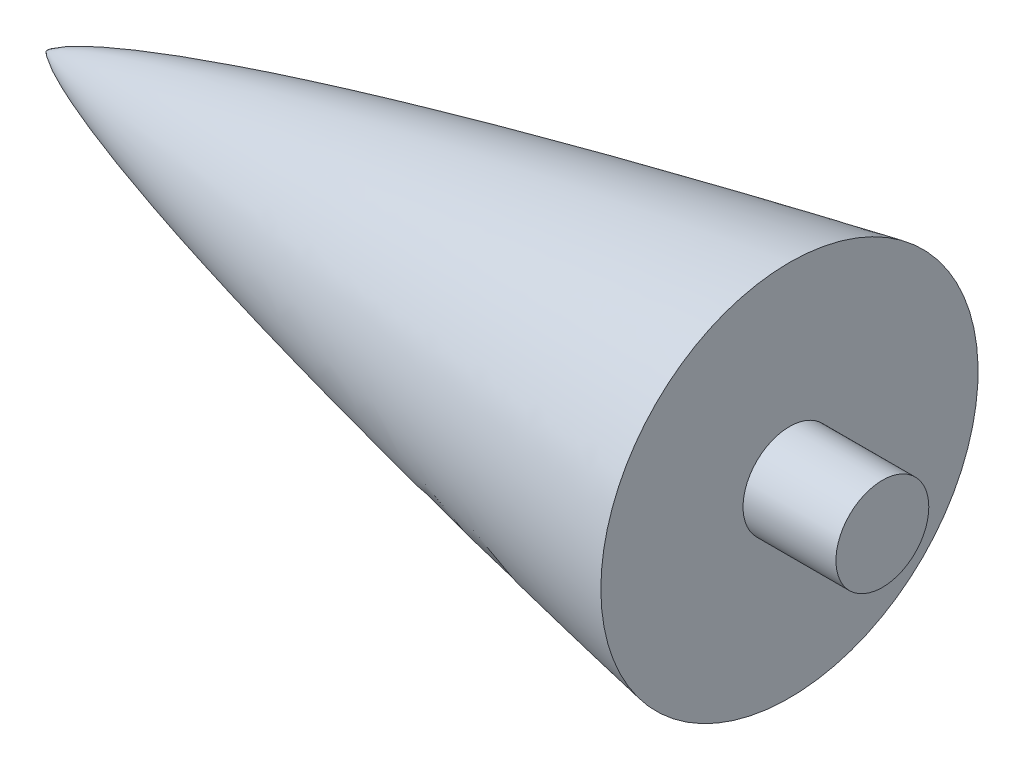
ISO-10303-21;
HEADER;
FILE_DESCRIPTION(('STEP AP214'),'2;1');
FILE_NAME('part.step','',(''),(''),'','','');
FILE_SCHEMA(('AUTOMOTIVE_DESIGN { 1 0 10303 214 1 1 1 1 }'));
ENDSEC;
DATA;
#1=APPLICATION_CONTEXT('core data for automotive mechanical design processes');
#2=APPLICATION_PROTOCOL_DEFINITION('international standard','automotive_design',2000,#1);
#3=PRODUCT_CONTEXT('',#1,'mechanical');
#4=PRODUCT('Part','Part','',(#3));
#5=PRODUCT_RELATED_PRODUCT_CATEGORY('part','',(#4));
#6=PRODUCT_DEFINITION_FORMATION('','',#4);
#7=PRODUCT_DEFINITION_CONTEXT('part definition',#1,'design');
#8=PRODUCT_DEFINITION('design','',#6,#7);
#9=PRODUCT_DEFINITION_SHAPE('','',#8);
#10=(LENGTH_UNIT() NAMED_UNIT(*) SI_UNIT(.MILLI.,.METRE.));
#11=(NAMED_UNIT(*) PLANE_ANGLE_UNIT() SI_UNIT($,.RADIAN.));
#12=(NAMED_UNIT(*) SI_UNIT($,.STERADIAN.) SOLID_ANGLE_UNIT());
#13=UNCERTAINTY_MEASURE_WITH_UNIT(LENGTH_MEASURE(1.E-05),#10,'distance_accuracy_value','');
#14=(GEOMETRIC_REPRESENTATION_CONTEXT(3) GLOBAL_UNCERTAINTY_ASSIGNED_CONTEXT((#13)) GLOBAL_UNIT_ASSIGNED_CONTEXT((#10,
#11,#12)) REPRESENTATION_CONTEXT('',''));
#15=CARTESIAN_POINT('',(0.,0.,0.));
#16=DIRECTION('',(0.,0.,1.));
#17=DIRECTION('',(1.,0.,0.));
#18=AXIS2_PLACEMENT_3D('',#15,#16,#17);
#19=CARTESIAN_POINT('',(0.,0.,0.));
#20=CARTESIAN_POINT('',(0.00238035997467733,0.0076011360778813,0.));
#21=CARTESIAN_POINT('',(0.00798466837960896,0.0223856697222698,0.));
#22=CARTESIAN_POINT('',(0.0228401150590813,0.0501833866003635,0.));
#23=CARTESIAN_POINT('',(0.0602326607252037,0.101267556911976,0.));
#24=CARTESIAN_POINT('',(0.117712206300395,0.166235145023001,0.));
#25=CARTESIAN_POINT('',(0.19726092234631,0.242935889185385,0.));
#26=CARTESIAN_POINT('',(0.316636954176446,0.345966558933334,0.));
#27=CARTESIAN_POINT('',(0.466313208156419,0.461855796292357,0.));
#28=CARTESIAN_POINT('',(0.64110457480571,0.585434487024376,0.));
#29=CARTESIAN_POINT('',(0.840927563647119,0.716336462312511,0.));
#30=CARTESIAN_POINT('',(1.08630400061248,0.868078740313604,0.));
#31=CARTESIAN_POINT('',(1.3805140783841,1.03915253918921,0.));
#32=CARTESIAN_POINT('',(1.73039943049731,1.23059941861425,0.));
#33=CARTESIAN_POINT('',(2.10392059668018,1.42354959389184,0.));
#34=CARTESIAN_POINT('',(2.44951561837744,1.59464165691464,0.));
#35=CARTESIAN_POINT('',(2.8342582543806,1.77902728884111,0.));
#36=CARTESIAN_POINT('',(3.32523532989474,2.00639453517896,0.));
#37=CARTESIAN_POINT('',(3.95823736587216,2.28701277693298,0.));
#38=CARTESIAN_POINT('',(5.24838346585034,2.83197588814661,0.));
#39=CARTESIAN_POINT('',(7.70022289015023,3.7871285095325,0.));
#40=CARTESIAN_POINT('',(12.4183987756164,5.43489889232549,0.));
#41=CARTESIAN_POINT('',(21.4878668486138,8.20445693610999,0.));
#42=CARTESIAN_POINT('',(34.2023586445507,11.5665873148162,0.));
#43=CARTESIAN_POINT('',(49.9837066694842,15.3040734435677,0.));
#44=CARTESIAN_POINT('',(77.2137650809594,21.1912043077746,0.));
#45=CARTESIAN_POINT('',(111.509421775575,27.7892992188203,0.));
#46=CARTESIAN_POINT('',(153.127410240743,35.0456177134566,0.));
#47=CARTESIAN_POINT('',(202.079624895492,42.8365860425714,0.));
#48=CARTESIAN_POINT('',(248.676771970826,49.7601957810546,0.));
#49=CARTESIAN_POINT('',(306.994191139808,57.9227193178528,0.));
#50=CARTESIAN_POINT('',(377.064507832727,67.0587719531232,0.));
#51=CARTESIAN_POINT('',(458.911254582009,76.93757318835,0.));
#52=CARTESIAN_POINT('',(552.552386087888,87.3435956773155,0.));
#53=CARTESIAN_POINT('',(646.27586099522,96.9776309007265,0.));
#54=CARTESIAN_POINT('',(740.068728044023,105.909330238405,0.));
#55=CARTESIAN_POINT('',(833.922122588579,114.180058458328,0.));
#56=CARTESIAN_POINT('',(927.829746144443,121.810111121398,0.));
#57=CARTESIAN_POINT('',(1021.7871091398,128.801272239229,0.));
#58=CARTESIAN_POINT('',(1115.79102912492,135.136696370842,0.));
#59=CARTESIAN_POINT('',(1198.0833333225,140.071466306922,0.));
#60=CARTESIAN_POINT('',(1268.64659039088,143.821063480985,0.));
#61=CARTESIAN_POINT('',(1327.46719210481,146.584126696369,0.));
#62=CARTESIAN_POINT('',(1374.5344213245,148.553508869585,0.));
#63=CARTESIAN_POINT('',(1414.76845078515,150.000622863617,0.));
#64=CARTESIAN_POINT('',(1448.16473396307,151.010913327166,0.));
#65=CARTESIAN_POINT('',(1474.7195583583,151.671460190239,0.));
#66=CARTESIAN_POINT('',(1491.96624087526,152.024358370583,0.));
#67=CARTESIAN_POINT('',(1506.75036650976,152.25898736052,0.));
#68=CARTESIAN_POINT('',(1516.60712853408,152.362707824974,0.));
#69=CARTESIAN_POINT('',(1521.53568050317,152.395628722459,0.));
#70=CARTESIAN_POINT('',(1524.,152.4,0.));
#71=B_SPLINE_CURVE_WITH_KNOTS('',4,(#19,#20,#21,#22,#23,#24,#25,#26,#27,#28,#29,#30,#31,#32,#33,
#34,#35,#36,#37,#38,#39,#40,#41,#42,#43,#44,#45,#46,#47,#48,#49,#50,#51,#52,#53,#54,#55,#56,#57,
#58,#59,#60,#61,#62,#63,#64,#65,#66,#67,#68,#69,#70),.UNSPECIFIED.,.F.,.F.,(5,1,1,1,1,1,1,1,1,1,
1,1,1,1,1,1,1,1,1,1,1,1,1,1,1,1,1,1,1,1,1,1,1,1,1,1,1,1,1,1,1,1,1,1,1,1,1,1,5),(0.,
2.05516393991926E-05,4.11032787983851E-05,8.22065575967702E-05,0.00016441311519354,
0.000246619672790311,0.000328826230387081,0.000493239345580621,0.000657652460774162,
0.000804573036816619,0.000951493612859076,0.00124533476494399,0.00154479174871456,
0.00184424873248513,0.00204745084835765,0.00225065296423016,0.0026570571959752,
0.00325478883200249,0.00385252046802978,0.00590167698954032,0.00951586252134176,
0.0162807635228404,0.0285690036013012,0.0401814036866866,0.051793803772072,0.0889073662699187,
0.11961078556872,0.15031420486752,0.181017621368193,0.211721037868866,0.27312787179488,
0.334534706421201,0.395941541348576,0.457348376315497,0.518755211151348,0.580162045729085,
0.641568880581471,0.702975716282408,0.764382551413628,0.825789385852659,0.85649280369749,
0.887196221542322,0.917899639147717,0.948603056753113,0.961452292564834,0.974301528376556,
0.987150764188278,0.993575382094139,1.),.UNSPECIFIED.);
#72=CARTESIAN_POINT('',(183.101312307485,0.,0.));
#73=DIRECTION('',(-1.,0.,0.));
#74=AXIS1_PLACEMENT('',#72,#73);
#75=SURFACE_OF_REVOLUTION('',#71,#74);
#76=CARTESIAN_POINT('',(101.6,0.,0.));
#77=DIRECTION('',(-1.,0.,0.));
#78=DIRECTION('',(0.,0.,1.));
#79=AXIS2_PLACEMENT_3D('',#76,#77,#78);
#80=CIRCLE('',#79,25.7872300095119);
#81=CARTESIAN_POINT('',(101.6,0.,25.7872300095119));
#82=VERTEX_POINT('',#81);
#83=EDGE_CURVE('E43',#82,#82,#80,.T.);
#84=ORIENTED_EDGE('',*,*,#83,.T.);
#85=EDGE_LOOP('',(#84));
#86=FACE_BOUND('',#85,.T.);
#87=CARTESIAN_POINT('',(0.,0.,0.));
#88=VERTEX_POINT('',#87);
#89=VERTEX_LOOP('',#88);
#90=FACE_BOUND('',#89,.T.);
#91=ADVANCED_FACE('F39',(#86,#90),#75,.F.);
#92=CARTESIAN_POINT('',(101.6,-1.0935515297718E-13,0.));
#93=DIRECTION('',(-1.,0.,0.));
#94=DIRECTION('',(0.,0.,1.));
#95=AXIS2_PLACEMENT_3D('',#92,#93,#94);
#96=PLANE('',#95);
#97=CARTESIAN_POINT('',(101.6,0.,0.));
#98=DIRECTION('',(1.,0.,0.));
#99=DIRECTION('',(0.,0.,-1.));
#100=AXIS2_PLACEMENT_3D('',#97,#98,#99);
#101=CIRCLE('',#100,6.35);
#102=CARTESIAN_POINT('',(101.6,0.,-6.35));
#103=VERTEX_POINT('',#102);
#104=EDGE_CURVE('E11',#103,#103,#101,.T.);
#105=ORIENTED_EDGE('',*,*,#104,.F.);
#106=EDGE_LOOP('',(#105));
#107=FACE_BOUND('',#106,.T.);
#108=ORIENTED_EDGE('',*,*,#83,.F.);
#109=EDGE_LOOP('',(#108));
#110=FACE_BOUND('',#109,.T.);
#111=ADVANCED_FACE('F50',(#107,#110),#96,.F.);
#112=CARTESIAN_POINT('',(114.3,0.,0.));
#113=DIRECTION('',(-1.,0.,0.));
#114=DIRECTION('',(0.,0.,1.));
#115=AXIS2_PLACEMENT_3D('',#112,#113,#114);
#116=CYLINDRICAL_SURFACE('',#115,6.35);
#117=CARTESIAN_POINT('',(114.3,0.,0.));
#118=DIRECTION('',(1.,0.,0.));
#119=DIRECTION('',(0.,0.,-1.));
#120=AXIS2_PLACEMENT_3D('',#117,#118,#119);
#121=CIRCLE('',#120,6.35);
#122=CARTESIAN_POINT('',(114.3,0.,-6.35));
#123=VERTEX_POINT('',#122);
#124=EDGE_CURVE('E60',#123,#123,#121,.T.);
#125=ORIENTED_EDGE('',*,*,#124,.F.);
#126=EDGE_LOOP('',(#125));
#127=FACE_BOUND('',#126,.T.);
#128=ORIENTED_EDGE('',*,*,#104,.T.);
#129=EDGE_LOOP('',(#128));
#130=FACE_BOUND('',#129,.T.);
#131=ADVANCED_FACE('F55',(#127,#130),#116,.T.);
#132=CARTESIAN_POINT('',(114.3,0.,0.));
#133=DIRECTION('',(1.,0.,0.));
#134=DIRECTION('',(0.,0.,-1.));
#135=AXIS2_PLACEMENT_3D('',#132,#133,#134);
#136=PLANE('',#135);
#137=ORIENTED_EDGE('',*,*,#124,.T.);
#138=EDGE_LOOP('',(#137));
#139=FACE_BOUND('',#138,.T.);
#140=ADVANCED_FACE('F71',(#139),#136,.T.);
#141=CLOSED_SHELL('',(#91,#111,#131,#140));
#142=MANIFOLD_SOLID_BREP('B2',#141);
#143=ADVANCED_BREP_SHAPE_REPRESENTATION('',(#18,#142),#14);
#144=SHAPE_DEFINITION_REPRESENTATION(#9,#143);
ENDSEC;
END-ISO-10303-21;
